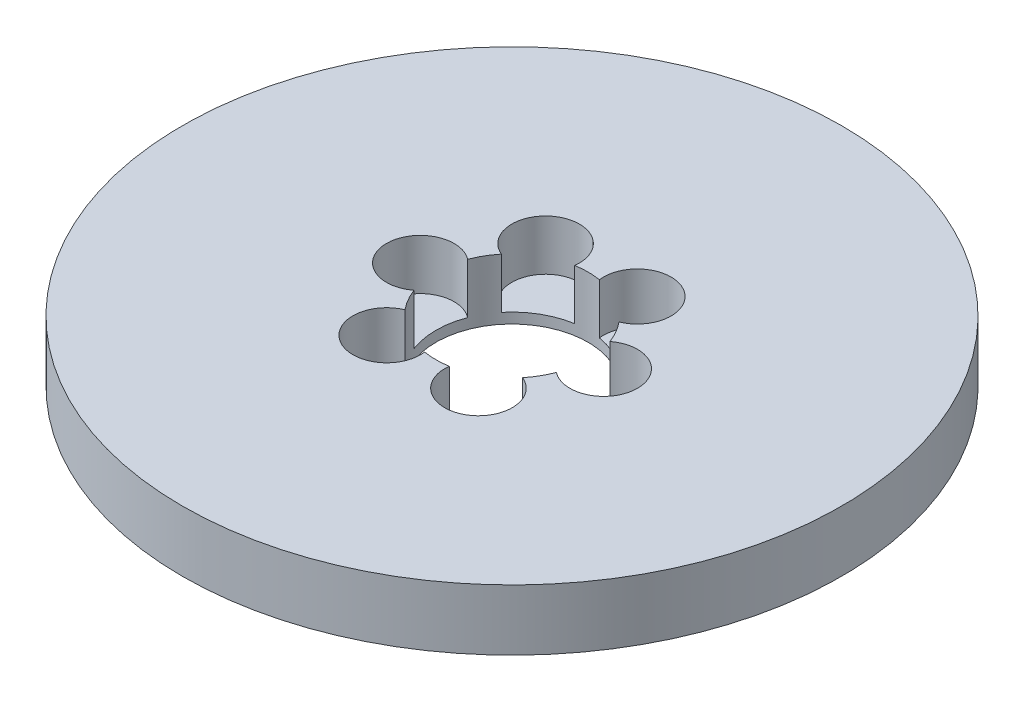
ISO-10303-21;
HEADER;
FILE_DESCRIPTION(('STEP AP214'),'2;1');
FILE_NAME('part.step','',(''),(''),'','','');
FILE_SCHEMA(('AUTOMOTIVE_DESIGN { 1 0 10303 214 1 1 1 1 }'));
ENDSEC;
DATA;
#1=APPLICATION_CONTEXT('core data for automotive mechanical design processes');
#2=APPLICATION_PROTOCOL_DEFINITION('international standard','automotive_design',2000,#1);
#3=PRODUCT_CONTEXT('',#1,'mechanical');
#4=PRODUCT('Part','Part','',(#3));
#5=PRODUCT_RELATED_PRODUCT_CATEGORY('part','',(#4));
#6=PRODUCT_DEFINITION_FORMATION('','',#4);
#7=PRODUCT_DEFINITION_CONTEXT('part definition',#1,'design');
#8=PRODUCT_DEFINITION('design','',#6,#7);
#9=PRODUCT_DEFINITION_SHAPE('','',#8);
#10=(LENGTH_UNIT() NAMED_UNIT(*) SI_UNIT(.MILLI.,.METRE.));
#11=(NAMED_UNIT(*) PLANE_ANGLE_UNIT() SI_UNIT($,.RADIAN.));
#12=(NAMED_UNIT(*) SI_UNIT($,.STERADIAN.) SOLID_ANGLE_UNIT());
#13=UNCERTAINTY_MEASURE_WITH_UNIT(LENGTH_MEASURE(1.E-05),#10,'distance_accuracy_value','');
#14=(GEOMETRIC_REPRESENTATION_CONTEXT(3) GLOBAL_UNCERTAINTY_ASSIGNED_CONTEXT((#13)) GLOBAL_UNIT_ASSIGNED_CONTEXT((#10,
#11,#12)) REPRESENTATION_CONTEXT('',''));
#15=CARTESIAN_POINT('',(0.,0.,0.));
#16=DIRECTION('',(0.,0.,1.));
#17=DIRECTION('',(1.,0.,0.));
#18=AXIS2_PLACEMENT_3D('',#15,#16,#17);
#19=CARTESIAN_POINT('',(0.,18.,0.));
#20=DIRECTION('',(0.,-1.,0.));
#21=DIRECTION('',(0.,0.,-1.));
#22=AXIS2_PLACEMENT_3D('',#19,#20,#21);
#23=CYLINDRICAL_SURFACE('',#22,97.5);
#24=CARTESIAN_POINT('',(0.,18.,0.));
#25=DIRECTION('',(0.,1.,0.));
#26=DIRECTION('',(0.,0.,1.));
#27=AXIS2_PLACEMENT_3D('',#24,#25,#26);
#28=CIRCLE('',#27,97.5);
#29=CARTESIAN_POINT('',(0.,18.,97.5));
#30=VERTEX_POINT('',#29);
#31=EDGE_CURVE('E171',#30,#30,#28,.T.);
#32=ORIENTED_EDGE('',*,*,#31,.F.);
#33=EDGE_LOOP('',(#32));
#34=FACE_BOUND('',#33,.T.);
#35=CARTESIAN_POINT('',(0.,0.,0.));
#36=DIRECTION('',(0.,1.,0.));
#37=DIRECTION('',(0.,0.,1.));
#38=AXIS2_PLACEMENT_3D('',#35,#36,#37);
#39=CIRCLE('',#38,97.5);
#40=CARTESIAN_POINT('',(0.,0.,97.5));
#41=VERTEX_POINT('',#40);
#42=EDGE_CURVE('E157',#41,#41,#39,.T.);
#43=ORIENTED_EDGE('',*,*,#42,.T.);
#44=EDGE_LOOP('',(#43));
#45=FACE_BOUND('',#44,.T.);
#46=ADVANCED_FACE('F39',(#34,#45),#23,.T.);
#47=CARTESIAN_POINT('',(0.,18.,0.));
#48=DIRECTION('',(0.,1.,0.));
#49=DIRECTION('',(0.,0.,1.));
#50=AXIS2_PLACEMENT_3D('',#47,#48,#49);
#51=PLANE('',#50);
#52=CARTESIAN_POINT('',(-13.5655394325628,18.,-23.4962035292773));
#53=DIRECTION('',(0.,1.,0.));
#54=DIRECTION('',(-0.866025403784433,0.,0.50000000000001));
#55=AXIS2_PLACEMENT_3D('',#52,#53,#54);
#56=CIRCLE('',#55,10.);
#57=CARTESIAN_POINT('',(-3.64963727725365,18.,-22.2020302617684));
#58=VERTEX_POINT('',#57);
#59=CARTESIAN_POINT('',(-17.4027035836558,18.,-14.2616937275841));
#60=VERTEX_POINT('',#59);
#61=EDGE_CURVE('E214',#58,#60,#56,.T.);
#62=ORIENTED_EDGE('',*,*,#61,.F.);
#63=CARTESIAN_POINT('',(0.,18.,0.));
#64=DIRECTION('',(0.,1.,0.));
#65=DIRECTION('',(0.,0.,1.));
#66=AXIS2_PLACEMENT_3D('',#63,#64,#65);
#67=CIRCLE('',#66,22.5);
#68=CARTESIAN_POINT('',(3.64963727725318,18.,-22.2020302617685));
#69=VERTEX_POINT('',#68);
#70=EDGE_CURVE('E272',#69,#58,#67,.T.);
#71=ORIENTED_EDGE('',*,*,#70,.F.);
#72=CARTESIAN_POINT('',(13.5655394325623,18.,-23.4962035292776));
#73=DIRECTION('',(0.,1.,0.));
#74=DIRECTION('',(-0.866025403784443,0.,-0.499999999999992));
#75=AXIS2_PLACEMENT_3D('',#72,#73,#74);
#76=CIRCLE('',#75,10.);
#77=CARTESIAN_POINT('',(17.4027035836555,18.,-14.2616937275845));
#78=VERTEX_POINT('',#77);
#79=EDGE_CURVE('E285',#78,#69,#76,.T.);
#80=ORIENTED_EDGE('',*,*,#79,.F.);
#81=CARTESIAN_POINT('',(21.0523408609091,18.,-7.94033653418413));
#82=VERTEX_POINT('',#81);
#83=EDGE_CURVE('E165',#82,#78,#67,.T.);
#84=ORIENTED_EDGE('',*,*,#83,.F.);
#85=CARTESIAN_POINT('',(27.1310788651251,18.,0.));
#86=DIRECTION('',(0.,1.,0.));
#87=DIRECTION('',(0.,0.,-1.));
#88=AXIS2_PLACEMENT_3D('',#85,#86,#87);
#89=CIRCLE('',#88,10.);
#90=CARTESIAN_POINT('',(21.0523408609091,18.,7.94033653418413));
#91=VERTEX_POINT('',#90);
#92=EDGE_CURVE('E281',#91,#82,#89,.T.);
#93=ORIENTED_EDGE('',*,*,#92,.F.);
#94=CARTESIAN_POINT('',(17.4027035836557,18.,14.2616937275843));
#95=VERTEX_POINT('',#94);
#96=EDGE_CURVE('E160',#95,#91,#67,.T.);
#97=ORIENTED_EDGE('',*,*,#96,.F.);
#98=CARTESIAN_POINT('',(13.5655394325627,18.,23.4962035292774));
#99=DIRECTION('',(0.,1.,0.));
#100=DIRECTION('',(0.866025403784436,0.,-0.500000000000004));
#101=AXIS2_PLACEMENT_3D('',#98,#99,#100);
#102=CIRCLE('',#101,10.);
#103=CARTESIAN_POINT('',(3.64963727725349,18.,22.2020302617684));
#104=VERTEX_POINT('',#103);
#105=EDGE_CURVE('E154',#104,#95,#102,.T.);
#106=ORIENTED_EDGE('',*,*,#105,.F.);
#107=CARTESIAN_POINT('',(-3.64963727725334,18.,22.2020302617685));
#108=VERTEX_POINT('',#107);
#109=EDGE_CURVE('E150',#108,#104,#67,.T.);
#110=ORIENTED_EDGE('',*,*,#109,.F.);
#111=CARTESIAN_POINT('',(-13.5655394325625,18.,23.4962035292775));
#112=DIRECTION('',(0.,1.,0.));
#113=DIRECTION('',(0.86602540378444,0.,0.499999999999998));
#114=AXIS2_PLACEMENT_3D('',#111,#112,#113);
#115=CIRCLE('',#114,10.);
#116=CARTESIAN_POINT('',(-17.4027035836556,18.,14.2616937275844));
#117=VERTEX_POINT('',#116);
#118=EDGE_CURVE('E127',#117,#108,#115,.T.);
#119=ORIENTED_EDGE('',*,*,#118,.F.);
#120=CARTESIAN_POINT('',(-21.0523408609091,18.,7.94033653418413));
#121=VERTEX_POINT('',#120);
#122=EDGE_CURVE('E156',#121,#117,#67,.T.);
#123=ORIENTED_EDGE('',*,*,#122,.F.);
#124=CARTESIAN_POINT('',(-27.1310788651251,18.,0.));
#125=DIRECTION('',(0.,1.,0.));
#126=DIRECTION('',(0.,0.,1.));
#127=AXIS2_PLACEMENT_3D('',#124,#125,#126);
#128=CIRCLE('',#127,10.);
#129=CARTESIAN_POINT('',(-21.0523408609091,18.,-7.94033653418413));
#130=VERTEX_POINT('',#129);
#131=EDGE_CURVE('E164',#130,#121,#128,.T.);
#132=ORIENTED_EDGE('',*,*,#131,.F.);
#133=EDGE_CURVE('E159',#60,#130,#67,.T.);
#134=ORIENTED_EDGE('',*,*,#133,.F.);
#135=EDGE_LOOP('',(#62,#71,#80,#84,#93,#97,#106,#110,#119,#123,#132,#134));
#136=FACE_BOUND('',#135,.T.);
#137=ORIENTED_EDGE('',*,*,#31,.T.);
#138=EDGE_LOOP('',(#137));
#139=FACE_BOUND('',#138,.T.);
#140=ADVANCED_FACE('F155',(#136,#139),#51,.T.);
#141=CARTESIAN_POINT('',(0.,0.,0.));
#142=DIRECTION('',(0.,1.,0.));
#143=DIRECTION('',(0.,0.,1.));
#144=AXIS2_PLACEMENT_3D('',#141,#142,#143);
#145=PLANE('',#144);
#146=CARTESIAN_POINT('',(0.,0.,0.));
#147=DIRECTION('',(0.,1.,0.));
#148=DIRECTION('',(0.,0.,1.));
#149=AXIS2_PLACEMENT_3D('',#146,#147,#148);
#150=CIRCLE('',#149,22.5);
#151=CARTESIAN_POINT('',(0.,0.,22.5));
#152=VERTEX_POINT('',#151);
#153=EDGE_CURVE('E170',#152,#152,#150,.T.);
#154=ORIENTED_EDGE('',*,*,#153,.T.);
#155=EDGE_LOOP('',(#154));
#156=FACE_BOUND('',#155,.T.);
#157=ORIENTED_EDGE('',*,*,#42,.F.);
#158=EDGE_LOOP('',(#157));
#159=FACE_BOUND('',#158,.T.);
#160=ADVANCED_FACE('F232',(#156,#159),#145,.F.);
#161=CARTESIAN_POINT('',(0.,18.,0.));
#162=DIRECTION('',(0.,-1.,0.));
#163=DIRECTION('',(0.,0.,-1.));
#164=AXIS2_PLACEMENT_3D('',#161,#162,#163);
#165=CYLINDRICAL_SURFACE('',#164,22.5);
#166=DIRECTION('',(0.,1.,0.));
#167=VECTOR('',#166,1.);
#168=CARTESIAN_POINT('',(-3.64963727725365,10.5356566937476,-22.2020302617684));
#169=LINE('',#168,#167);
#170=CARTESIAN_POINT('',(-3.64963727725365,3.07131338749518,-22.2020302617684));
#171=VERTEX_POINT('',#170);
#172=EDGE_CURVE('E11',#171,#58,#169,.T.);
#173=ORIENTED_EDGE('',*,*,#172,.F.);
#174=CARTESIAN_POINT('',(0.,3.07131338749518,0.));
#175=DIRECTION('',(0.,1.,0.));
#176=DIRECTION('',(0.,0.,1.));
#177=AXIS2_PLACEMENT_3D('',#174,#175,#176);
#178=CIRCLE('',#177,22.5);
#179=CARTESIAN_POINT('',(-17.4027035836558,3.07131338749518,-14.2616937275841));
#180=VERTEX_POINT('',#179);
#181=EDGE_CURVE('E209',#171,#180,#178,.T.);
#182=ORIENTED_EDGE('',*,*,#181,.T.);
#183=DIRECTION('',(0.,1.,0.));
#184=VECTOR('',#183,1.);
#185=CARTESIAN_POINT('',(-17.4027035836558,10.5356566937476,-14.2616937275841));
#186=LINE('',#185,#184);
#187=EDGE_CURVE('E46',#60,#180,#186,.F.);
#188=ORIENTED_EDGE('',*,*,#187,.F.);
#189=ORIENTED_EDGE('',*,*,#133,.T.);
#190=DIRECTION('',(0.,1.,0.));
#191=VECTOR('',#190,1.);
#192=CARTESIAN_POINT('',(-21.0523408609091,10.5356566937476,-7.94033653418412));
#193=LINE('',#192,#191);
#194=CARTESIAN_POINT('',(-21.0523408609091,3.07131338749518,-7.94033653418413));
#195=VERTEX_POINT('',#194);
#196=EDGE_CURVE('E185',#195,#130,#193,.T.);
#197=ORIENTED_EDGE('',*,*,#196,.F.);
#198=CARTESIAN_POINT('',(0.,3.07131338749518,0.));
#199=DIRECTION('',(0.,1.,0.));
#200=DIRECTION('',(0.,0.,1.));
#201=AXIS2_PLACEMENT_3D('',#198,#199,#200);
#202=CIRCLE('',#201,22.5);
#203=CARTESIAN_POINT('',(-21.0523408609091,3.07131338749518,7.94033653418413));
#204=VERTEX_POINT('',#203);
#205=EDGE_CURVE('E173',#195,#204,#202,.T.);
#206=ORIENTED_EDGE('',*,*,#205,.T.);
#207=DIRECTION('',(0.,1.,0.));
#208=VECTOR('',#207,1.);
#209=CARTESIAN_POINT('',(-21.0523408609091,10.5356566937476,7.94033653418412));
#210=LINE('',#209,#208);
#211=EDGE_CURVE('E178',#121,#204,#210,.F.);
#212=ORIENTED_EDGE('',*,*,#211,.F.);
#213=ORIENTED_EDGE('',*,*,#122,.T.);
#214=DIRECTION('',(0.,1.,0.));
#215=VECTOR('',#214,1.);
#216=CARTESIAN_POINT('',(-17.4027035836556,10.5356566937476,14.2616937275844));
#217=LINE('',#216,#215);
#218=CARTESIAN_POINT('',(-17.4027035836556,3.07131338749518,14.2616937275844));
#219=VERTEX_POINT('',#218);
#220=EDGE_CURVE('E132',#219,#117,#217,.T.);
#221=ORIENTED_EDGE('',*,*,#220,.F.);
#222=CARTESIAN_POINT('',(0.,3.07131338749518,0.));
#223=DIRECTION('',(0.,1.,0.));
#224=DIRECTION('',(0.,0.,1.));
#225=AXIS2_PLACEMENT_3D('',#222,#223,#224);
#226=CIRCLE('',#225,22.5);
#227=CARTESIAN_POINT('',(-3.64963727725334,3.07131338749518,22.2020302617685));
#228=VERTEX_POINT('',#227);
#229=EDGE_CURVE('E146',#219,#228,#226,.T.);
#230=ORIENTED_EDGE('',*,*,#229,.T.);
#231=DIRECTION('',(0.,1.,0.));
#232=VECTOR('',#231,1.);
#233=CARTESIAN_POINT('',(-3.64963727725334,10.5356566937476,22.2020302617685));
#234=LINE('',#233,#232);
#235=EDGE_CURVE('E128',#108,#228,#234,.F.);
#236=ORIENTED_EDGE('',*,*,#235,.F.);
#237=ORIENTED_EDGE('',*,*,#109,.T.);
#238=DIRECTION('',(0.,1.,0.));
#239=VECTOR('',#238,1.);
#240=CARTESIAN_POINT('',(3.64963727725349,10.5356566937476,22.2020302617684));
#241=LINE('',#240,#239);
#242=CARTESIAN_POINT('',(3.64963727725349,3.07131338749518,22.2020302617684));
#243=VERTEX_POINT('',#242);
#244=EDGE_CURVE('E192',#243,#104,#241,.T.);
#245=ORIENTED_EDGE('',*,*,#244,.F.);
#246=CARTESIAN_POINT('',(0.,3.07131338749518,0.));
#247=DIRECTION('',(0.,1.,0.));
#248=DIRECTION('',(0.,0.,1.));
#249=AXIS2_PLACEMENT_3D('',#246,#247,#248);
#250=CIRCLE('',#249,22.5);
#251=CARTESIAN_POINT('',(17.4027035836557,3.07131338749518,14.2616937275843));
#252=VERTEX_POINT('',#251);
#253=EDGE_CURVE('E190',#243,#252,#250,.T.);
#254=ORIENTED_EDGE('',*,*,#253,.T.);
#255=DIRECTION('',(0.,1.,0.));
#256=VECTOR('',#255,1.);
#257=CARTESIAN_POINT('',(17.4027035836557,10.5356566937476,14.2616937275843));
#258=LINE('',#257,#256);
#259=EDGE_CURVE('E189',#95,#252,#258,.F.);
#260=ORIENTED_EDGE('',*,*,#259,.F.);
#261=ORIENTED_EDGE('',*,*,#96,.T.);
#262=DIRECTION('',(0.,1.,0.));
#263=VECTOR('',#262,1.);
#264=CARTESIAN_POINT('',(21.0523408609091,10.5356566937476,7.94033653418412));
#265=LINE('',#264,#263);
#266=CARTESIAN_POINT('',(21.0523408609091,3.07131338749518,7.94033653418413));
#267=VERTEX_POINT('',#266);
#268=EDGE_CURVE('E203',#267,#91,#265,.T.);
#269=ORIENTED_EDGE('',*,*,#268,.F.);
#270=CARTESIAN_POINT('',(0.,3.07131338749518,0.));
#271=DIRECTION('',(0.,1.,0.));
#272=DIRECTION('',(0.,0.,1.));
#273=AXIS2_PLACEMENT_3D('',#270,#271,#272);
#274=CIRCLE('',#273,22.5);
#275=CARTESIAN_POINT('',(21.0523408609091,3.07131338749518,-7.94033653418413));
#276=VERTEX_POINT('',#275);
#277=EDGE_CURVE('E194',#267,#276,#274,.T.);
#278=ORIENTED_EDGE('',*,*,#277,.T.);
#279=DIRECTION('',(0.,1.,0.));
#280=VECTOR('',#279,1.);
#281=CARTESIAN_POINT('',(21.0523408609091,10.5356566937476,-7.94033653418412));
#282=LINE('',#281,#280);
#283=EDGE_CURVE('E196',#82,#276,#282,.F.);
#284=ORIENTED_EDGE('',*,*,#283,.F.);
#285=ORIENTED_EDGE('',*,*,#83,.T.);
#286=DIRECTION('',(0.,1.,0.));
#287=VECTOR('',#286,1.);
#288=CARTESIAN_POINT('',(17.4027035836555,10.5356566937476,-14.2616937275845));
#289=LINE('',#288,#287);
#290=CARTESIAN_POINT('',(17.4027035836555,3.07131338749518,-14.2616937275845));
#291=VERTEX_POINT('',#290);
#292=EDGE_CURVE('E208',#291,#78,#289,.T.);
#293=ORIENTED_EDGE('',*,*,#292,.F.);
#294=CARTESIAN_POINT('',(0.,3.07131338749518,0.));
#295=DIRECTION('',(0.,1.,0.));
#296=DIRECTION('',(0.,0.,1.));
#297=AXIS2_PLACEMENT_3D('',#294,#295,#296);
#298=CIRCLE('',#297,22.5);
#299=CARTESIAN_POINT('',(3.64963727725318,3.07131338749518,-22.2020302617685));
#300=VERTEX_POINT('',#299);
#301=EDGE_CURVE('E201',#291,#300,#298,.T.);
#302=ORIENTED_EDGE('',*,*,#301,.T.);
#303=DIRECTION('',(0.,1.,0.));
#304=VECTOR('',#303,1.);
#305=CARTESIAN_POINT('',(3.64963727725318,10.5356566937476,-22.2020302617685));
#306=LINE('',#305,#304);
#307=EDGE_CURVE('E206',#69,#300,#306,.F.);
#308=ORIENTED_EDGE('',*,*,#307,.F.);
#309=ORIENTED_EDGE('',*,*,#70,.T.);
#310=EDGE_LOOP('',(#173,#182,#188,#189,#197,#206,#212,#213,#221,#230,#236,#237,#245,#254,#260,
#261,#269,#278,#284,#285,#293,#302,#308,#309));
#311=FACE_BOUND('',#310,.T.);
#312=ORIENTED_EDGE('',*,*,#153,.F.);
#313=EDGE_LOOP('',(#312));
#314=FACE_BOUND('',#313,.T.);
#315=ADVANCED_FACE('F145',(#311,#314),#165,.F.);
#316=CARTESIAN_POINT('',(-27.1310788651251,3.07131338749518,0.));
#317=DIRECTION('',(0.,1.,0.));
#318=DIRECTION('',(0.,0.,1.));
#319=AXIS2_PLACEMENT_3D('',#316,#317,#318);
#320=CYLINDRICAL_SURFACE('',#319,10.);
#321=ORIENTED_EDGE('',*,*,#196,.T.);
#322=ORIENTED_EDGE('',*,*,#131,.T.);
#323=ORIENTED_EDGE('',*,*,#211,.T.);
#324=CARTESIAN_POINT('',(-27.1310788651251,3.07131338749518,0.));
#325=DIRECTION('',(0.,1.,0.));
#326=DIRECTION('',(0.,0.,1.));
#327=AXIS2_PLACEMENT_3D('',#324,#325,#326);
#328=CIRCLE('',#327,10.);
#329=EDGE_CURVE('E168',#195,#204,#328,.T.);
#330=ORIENTED_EDGE('',*,*,#329,.F.);
#331=EDGE_LOOP('',(#321,#322,#323,#330));
#332=FACE_BOUND('',#331,.T.);
#333=ADVANCED_FACE('F243',(#332),#320,.F.);
#334=CARTESIAN_POINT('',(-27.1310788651251,3.07131338749518,0.));
#335=DIRECTION('',(0.,1.,0.));
#336=DIRECTION('',(0.,0.,1.));
#337=AXIS2_PLACEMENT_3D('',#334,#335,#336);
#338=PLANE('',#337);
#339=ORIENTED_EDGE('',*,*,#329,.T.);
#340=ORIENTED_EDGE('',*,*,#205,.F.);
#341=EDGE_LOOP('',(#339,#340));
#342=FACE_BOUND('',#341,.T.);
#343=ADVANCED_FACE('F247',(#342),#338,.T.);
#344=CARTESIAN_POINT('',(-13.5655394325625,3.07131338749518,23.4962035292775));
#345=DIRECTION('',(0.,1.,0.));
#346=DIRECTION('',(0.,0.,1.));
#347=AXIS2_PLACEMENT_3D('',#344,#345,#346);
#348=CYLINDRICAL_SURFACE('',#347,10.);
#349=ORIENTED_EDGE('',*,*,#220,.T.);
#350=ORIENTED_EDGE('',*,*,#118,.T.);
#351=ORIENTED_EDGE('',*,*,#235,.T.);
#352=CARTESIAN_POINT('',(-13.5655394325625,3.07131338749518,23.4962035292775));
#353=DIRECTION('',(0.,1.,0.));
#354=DIRECTION('',(0.86602540378444,0.,0.499999999999998));
#355=AXIS2_PLACEMENT_3D('',#352,#353,#354);
#356=CIRCLE('',#355,10.);
#357=EDGE_CURVE('E137',#219,#228,#356,.T.);
#358=ORIENTED_EDGE('',*,*,#357,.F.);
#359=EDGE_LOOP('',(#349,#350,#351,#358));
#360=FACE_BOUND('',#359,.T.);
#361=ADVANCED_FACE('F126',(#360),#348,.F.);
#362=CARTESIAN_POINT('',(-13.5655394325625,3.07131338749518,23.4962035292775));
#363=DIRECTION('',(0.,1.,0.));
#364=DIRECTION('',(0.86602540378444,0.,0.499999999999998));
#365=AXIS2_PLACEMENT_3D('',#362,#363,#364);
#366=PLANE('',#365);
#367=ORIENTED_EDGE('',*,*,#357,.T.);
#368=ORIENTED_EDGE('',*,*,#229,.F.);
#369=EDGE_LOOP('',(#367,#368));
#370=FACE_BOUND('',#369,.T.);
#371=ADVANCED_FACE('F254',(#370),#366,.T.);
#372=CARTESIAN_POINT('',(13.5655394325627,3.07131338749518,23.4962035292774));
#373=DIRECTION('',(0.,1.,0.));
#374=DIRECTION('',(0.,0.,1.));
#375=AXIS2_PLACEMENT_3D('',#372,#373,#374);
#376=CYLINDRICAL_SURFACE('',#375,10.);
#377=ORIENTED_EDGE('',*,*,#244,.T.);
#378=ORIENTED_EDGE('',*,*,#105,.T.);
#379=ORIENTED_EDGE('',*,*,#259,.T.);
#380=CARTESIAN_POINT('',(13.5655394325627,3.07131338749518,23.4962035292774));
#381=DIRECTION('',(0.,1.,0.));
#382=DIRECTION('',(0.866025403784436,0.,-0.500000000000004));
#383=AXIS2_PLACEMENT_3D('',#380,#381,#382);
#384=CIRCLE('',#383,10.);
#385=EDGE_CURVE('E138',#243,#252,#384,.T.);
#386=ORIENTED_EDGE('',*,*,#385,.F.);
#387=EDGE_LOOP('',(#377,#378,#379,#386));
#388=FACE_BOUND('',#387,.T.);
#389=ADVANCED_FACE('F260',(#388),#376,.F.);
#390=CARTESIAN_POINT('',(13.5655394325627,3.07131338749518,23.4962035292774));
#391=DIRECTION('',(0.,1.,0.));
#392=DIRECTION('',(0.866025403784436,0.,-0.500000000000004));
#393=AXIS2_PLACEMENT_3D('',#390,#391,#392);
#394=PLANE('',#393);
#395=ORIENTED_EDGE('',*,*,#385,.T.);
#396=ORIENTED_EDGE('',*,*,#253,.F.);
#397=EDGE_LOOP('',(#395,#396));
#398=FACE_BOUND('',#397,.T.);
#399=ADVANCED_FACE('F265',(#398),#394,.T.);
#400=CARTESIAN_POINT('',(27.1310788651251,3.07131338749518,0.));
#401=DIRECTION('',(0.,1.,0.));
#402=DIRECTION('',(0.,0.,1.));
#403=AXIS2_PLACEMENT_3D('',#400,#401,#402);
#404=CYLINDRICAL_SURFACE('',#403,10.);
#405=ORIENTED_EDGE('',*,*,#268,.T.);
#406=ORIENTED_EDGE('',*,*,#92,.T.);
#407=ORIENTED_EDGE('',*,*,#283,.T.);
#408=CARTESIAN_POINT('',(27.1310788651251,3.07131338749518,0.));
#409=DIRECTION('',(0.,1.,0.));
#410=DIRECTION('',(0.,0.,-1.));
#411=AXIS2_PLACEMENT_3D('',#408,#409,#410);
#412=CIRCLE('',#411,10.);
#413=EDGE_CURVE('E287',#267,#276,#412,.T.);
#414=ORIENTED_EDGE('',*,*,#413,.F.);
#415=EDGE_LOOP('',(#405,#406,#407,#414));
#416=FACE_BOUND('',#415,.T.);
#417=ADVANCED_FACE('F300',(#416),#404,.F.);
#418=CARTESIAN_POINT('',(27.1310788651251,3.07131338749518,0.));
#419=DIRECTION('',(0.,1.,0.));
#420=DIRECTION('',(0.,0.,-1.));
#421=AXIS2_PLACEMENT_3D('',#418,#419,#420);
#422=PLANE('',#421);
#423=ORIENTED_EDGE('',*,*,#413,.T.);
#424=ORIENTED_EDGE('',*,*,#277,.F.);
#425=EDGE_LOOP('',(#423,#424));
#426=FACE_BOUND('',#425,.T.);
#427=ADVANCED_FACE('F298',(#426),#422,.T.);
#428=CARTESIAN_POINT('',(13.5655394325623,3.07131338749518,-23.4962035292776));
#429=DIRECTION('',(0.,1.,0.));
#430=DIRECTION('',(0.,0.,1.));
#431=AXIS2_PLACEMENT_3D('',#428,#429,#430);
#432=CYLINDRICAL_SURFACE('',#431,10.);
#433=ORIENTED_EDGE('',*,*,#292,.T.);
#434=ORIENTED_EDGE('',*,*,#79,.T.);
#435=ORIENTED_EDGE('',*,*,#307,.T.);
#436=CARTESIAN_POINT('',(13.5655394325623,3.07131338749518,-23.4962035292776));
#437=DIRECTION('',(0.,1.,0.));
#438=DIRECTION('',(-0.866025403784443,0.,-0.499999999999992));
#439=AXIS2_PLACEMENT_3D('',#436,#437,#438);
#440=CIRCLE('',#439,10.);
#441=EDGE_CURVE('E56',#291,#300,#440,.T.);
#442=ORIENTED_EDGE('',*,*,#441,.F.);
#443=EDGE_LOOP('',(#433,#434,#435,#442));
#444=FACE_BOUND('',#443,.T.);
#445=ADVANCED_FACE('F301',(#444),#432,.F.);
#446=CARTESIAN_POINT('',(13.5655394325623,3.07131338749518,-23.4962035292776));
#447=DIRECTION('',(0.,1.,0.));
#448=DIRECTION('',(-0.866025403784443,0.,-0.499999999999992));
#449=AXIS2_PLACEMENT_3D('',#446,#447,#448);
#450=PLANE('',#449);
#451=ORIENTED_EDGE('',*,*,#441,.T.);
#452=ORIENTED_EDGE('',*,*,#301,.F.);
#453=EDGE_LOOP('',(#451,#452));
#454=FACE_BOUND('',#453,.T.);
#455=ADVANCED_FACE('F221',(#454),#450,.T.);
#456=CARTESIAN_POINT('',(-13.5655394325628,3.07131338749518,-23.4962035292773));
#457=DIRECTION('',(0.,1.,0.));
#458=DIRECTION('',(0.,0.,1.));
#459=AXIS2_PLACEMENT_3D('',#456,#457,#458);
#460=CYLINDRICAL_SURFACE('',#459,10.);
#461=ORIENTED_EDGE('',*,*,#172,.T.);
#462=ORIENTED_EDGE('',*,*,#61,.T.);
#463=ORIENTED_EDGE('',*,*,#187,.T.);
#464=CARTESIAN_POINT('',(-13.5655394325628,3.07131338749518,-23.4962035292773));
#465=DIRECTION('',(0.,1.,0.));
#466=DIRECTION('',(-0.866025403784433,0.,0.50000000000001));
#467=AXIS2_PLACEMENT_3D('',#464,#465,#466);
#468=CIRCLE('',#467,10.);
#469=EDGE_CURVE('E55',#171,#180,#468,.T.);
#470=ORIENTED_EDGE('',*,*,#469,.F.);
#471=EDGE_LOOP('',(#461,#462,#463,#470));
#472=FACE_BOUND('',#471,.T.);
#473=ADVANCED_FACE('F212',(#472),#460,.F.);
#474=CARTESIAN_POINT('',(-13.5655394325628,3.07131338749518,-23.4962035292773));
#475=DIRECTION('',(0.,1.,0.));
#476=DIRECTION('',(-0.866025403784433,0.,0.50000000000001));
#477=AXIS2_PLACEMENT_3D('',#474,#475,#476);
#478=PLANE('',#477);
#479=ORIENTED_EDGE('',*,*,#469,.T.);
#480=ORIENTED_EDGE('',*,*,#181,.F.);
#481=EDGE_LOOP('',(#479,#480));
#482=FACE_BOUND('',#481,.T.);
#483=ADVANCED_FACE('F217',(#482),#478,.T.);
#484=CLOSED_SHELL('',(#46,#140,#160,#315,#333,#343,#361,#371,#389,#399,#417,#427,#445,#455,#473,#483));
#485=MANIFOLD_SOLID_BREP('B2',#484);
#486=ADVANCED_BREP_SHAPE_REPRESENTATION('',(#18,#485),#14);
#487=SHAPE_DEFINITION_REPRESENTATION(#9,#486);
ENDSEC;
END-ISO-10303-21;
